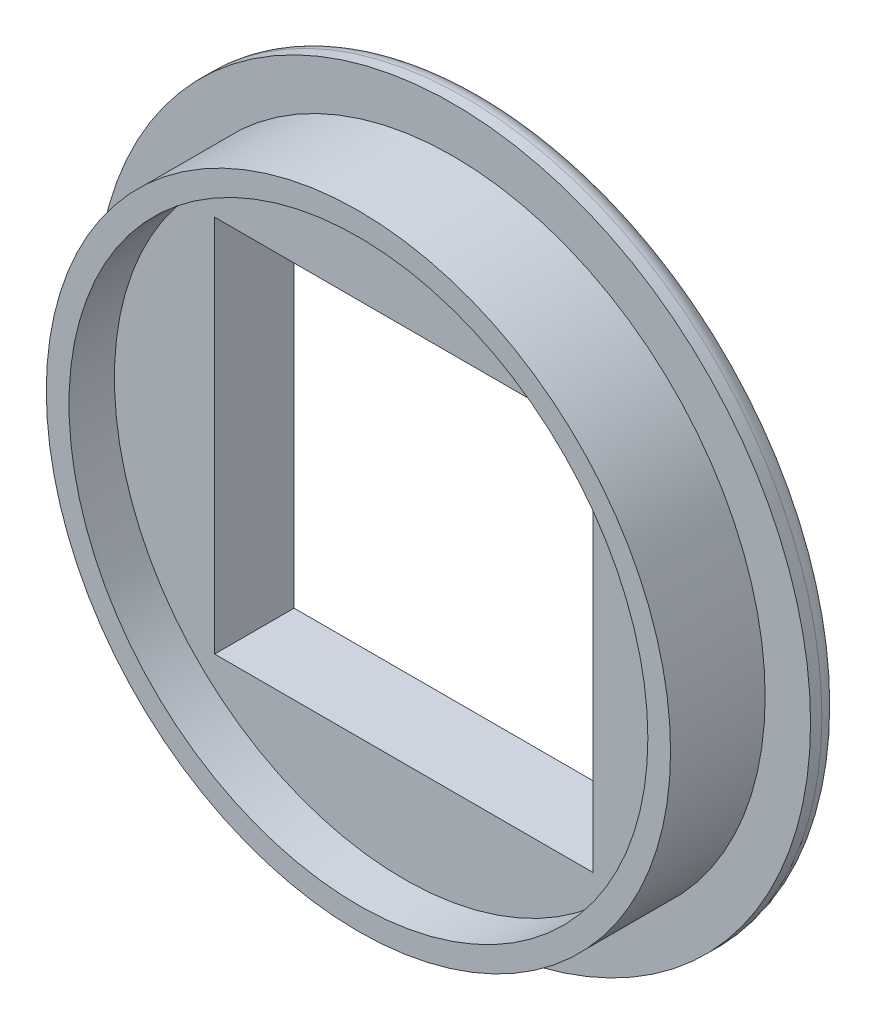
ISO-10303-21;
HEADER;
FILE_DESCRIPTION(('STEP AP214'),'2;1');
FILE_NAME('part.step','',(''),(''),'','','');
FILE_SCHEMA(('AUTOMOTIVE_DESIGN { 1 0 10303 214 1 1 1 1 }'));
ENDSEC;
DATA;
#1=APPLICATION_CONTEXT('core data for automotive mechanical design processes');
#2=APPLICATION_PROTOCOL_DEFINITION('international standard','automotive_design',2000,#1);
#3=PRODUCT_CONTEXT('',#1,'mechanical');
#4=PRODUCT('Part','Part','',(#3));
#5=PRODUCT_RELATED_PRODUCT_CATEGORY('part','',(#4));
#6=PRODUCT_DEFINITION_FORMATION('','',#4);
#7=PRODUCT_DEFINITION_CONTEXT('part definition',#1,'design');
#8=PRODUCT_DEFINITION('design','',#6,#7);
#9=PRODUCT_DEFINITION_SHAPE('','',#8);
#10=(LENGTH_UNIT() NAMED_UNIT(*) SI_UNIT(.MILLI.,.METRE.));
#11=(NAMED_UNIT(*) PLANE_ANGLE_UNIT() SI_UNIT($,.RADIAN.));
#12=(NAMED_UNIT(*) SI_UNIT($,.STERADIAN.) SOLID_ANGLE_UNIT());
#13=UNCERTAINTY_MEASURE_WITH_UNIT(LENGTH_MEASURE(1.E-05),#10,'distance_accuracy_value','');
#14=(GEOMETRIC_REPRESENTATION_CONTEXT(3) GLOBAL_UNCERTAINTY_ASSIGNED_CONTEXT((#13)) GLOBAL_UNIT_ASSIGNED_CONTEXT((#10,
#11,#12)) REPRESENTATION_CONTEXT('',''));
#15=CARTESIAN_POINT('',(0.,0.,0.));
#16=DIRECTION('',(0.,0.,1.));
#17=DIRECTION('',(1.,0.,0.));
#18=AXIS2_PLACEMENT_3D('',#15,#16,#17);
#19=CARTESIAN_POINT('',(5.,-5.,3.3));
#20=DIRECTION('',(-1.,0.,0.));
#21=DIRECTION('',(0.,0.,1.));
#22=AXIS2_PLACEMENT_3D('',#19,#20,#21);
#23=PLANE('',#22);
#24=DIRECTION('',(0.,0.,-1.));
#25=VECTOR('',#24,1.);
#26=CARTESIAN_POINT('',(5.,-5.,3.3));
#27=LINE('',#26,#25);
#28=CARTESIAN_POINT('',(5.,-5.,2.1));
#29=VERTEX_POINT('',#28);
#30=CARTESIAN_POINT('',(5.,-5.,0.));
#31=VERTEX_POINT('',#30);
#32=EDGE_CURVE('E56',#29,#31,#27,.T.);
#33=ORIENTED_EDGE('',*,*,#32,.F.);
#34=DIRECTION('',(0.,1.,0.));
#35=VECTOR('',#34,1.);
#36=CARTESIAN_POINT('',(5.,-5.,2.1));
#37=LINE('',#36,#35);
#38=CARTESIAN_POINT('',(5.,5.,2.1));
#39=VERTEX_POINT('',#38);
#40=EDGE_CURVE('E49',#29,#39,#37,.T.);
#41=ORIENTED_EDGE('',*,*,#40,.T.);
#42=DIRECTION('',(0.,0.,-1.));
#43=VECTOR('',#42,1.);
#44=CARTESIAN_POINT('',(5.,5.,3.3));
#45=LINE('',#44,#43);
#46=CARTESIAN_POINT('',(5.,5.,0.));
#47=VERTEX_POINT('',#46);
#48=EDGE_CURVE('E96',#39,#47,#45,.T.);
#49=ORIENTED_EDGE('',*,*,#48,.T.);
#50=DIRECTION('',(0.,1.,0.));
#51=VECTOR('',#50,1.);
#52=CARTESIAN_POINT('',(5.,-5.,0.));
#53=LINE('',#52,#51);
#54=EDGE_CURVE('E150',#31,#47,#53,.T.);
#55=ORIENTED_EDGE('',*,*,#54,.F.);
#56=EDGE_LOOP('',(#33,#41,#49,#55));
#57=FACE_BOUND('',#56,.T.);
#58=ADVANCED_FACE('F34',(#57),#23,.T.);
#59=CARTESIAN_POINT('',(-5.,5.,3.3));
#60=DIRECTION('',(0.,-1.,0.));
#61=DIRECTION('',(0.,0.,-1.));
#62=AXIS2_PLACEMENT_3D('',#59,#60,#61);
#63=PLANE('',#62);
#64=ORIENTED_EDGE('',*,*,#48,.F.);
#65=DIRECTION('',(-1.,0.,0.));
#66=VECTOR('',#65,1.);
#67=CARTESIAN_POINT('',(-5.,5.,2.1));
#68=LINE('',#67,#66);
#69=CARTESIAN_POINT('',(-5.,5.,2.1));
#70=VERTEX_POINT('',#69);
#71=EDGE_CURVE('E88',#39,#70,#68,.T.);
#72=ORIENTED_EDGE('',*,*,#71,.T.);
#73=DIRECTION('',(0.,0.,-1.));
#74=VECTOR('',#73,1.);
#75=CARTESIAN_POINT('',(-5.,5.,3.3));
#76=LINE('',#75,#74);
#77=CARTESIAN_POINT('',(-5.,5.,0.));
#78=VERTEX_POINT('',#77);
#79=EDGE_CURVE('E87',#70,#78,#76,.T.);
#80=ORIENTED_EDGE('',*,*,#79,.T.);
#81=DIRECTION('',(-1.,0.,0.));
#82=VECTOR('',#81,1.);
#83=CARTESIAN_POINT('',(-5.,5.,0.));
#84=LINE('',#83,#82);
#85=EDGE_CURVE('E154',#47,#78,#84,.T.);
#86=ORIENTED_EDGE('',*,*,#85,.F.);
#87=EDGE_LOOP('',(#64,#72,#80,#86));
#88=FACE_BOUND('',#87,.T.);
#89=ADVANCED_FACE('F118',(#88),#63,.T.);
#90=CARTESIAN_POINT('',(-5.,-5.,3.3));
#91=DIRECTION('',(1.,0.,0.));
#92=DIRECTION('',(0.,0.,-1.));
#93=AXIS2_PLACEMENT_3D('',#90,#91,#92);
#94=PLANE('',#93);
#95=ORIENTED_EDGE('',*,*,#79,.F.);
#96=DIRECTION('',(0.,-1.,0.));
#97=VECTOR('',#96,1.);
#98=CARTESIAN_POINT('',(-5.,-5.,2.1));
#99=LINE('',#98,#97);
#100=CARTESIAN_POINT('',(-5.,-5.,2.1));
#101=VERTEX_POINT('',#100);
#102=EDGE_CURVE('E77',#70,#101,#99,.T.);
#103=ORIENTED_EDGE('',*,*,#102,.T.);
#104=DIRECTION('',(0.,0.,-1.));
#105=VECTOR('',#104,1.);
#106=CARTESIAN_POINT('',(-5.,-5.,3.3));
#107=LINE('',#106,#105);
#108=CARTESIAN_POINT('',(-5.,-5.,0.));
#109=VERTEX_POINT('',#108);
#110=EDGE_CURVE('E86',#101,#109,#107,.T.);
#111=ORIENTED_EDGE('',*,*,#110,.T.);
#112=DIRECTION('',(0.,-1.,0.));
#113=VECTOR('',#112,1.);
#114=CARTESIAN_POINT('',(-5.,-5.,0.));
#115=LINE('',#114,#113);
#116=EDGE_CURVE('E162',#78,#109,#115,.T.);
#117=ORIENTED_EDGE('',*,*,#116,.F.);
#118=EDGE_LOOP('',(#95,#103,#111,#117));
#119=FACE_BOUND('',#118,.T.);
#120=ADVANCED_FACE('F84',(#119),#94,.T.);
#121=CARTESIAN_POINT('',(-5.,-5.,3.3));
#122=DIRECTION('',(0.,1.,0.));
#123=DIRECTION('',(0.,0.,1.));
#124=AXIS2_PLACEMENT_3D('',#121,#122,#123);
#125=PLANE('',#124);
#126=ORIENTED_EDGE('',*,*,#110,.F.);
#127=DIRECTION('',(1.,0.,0.));
#128=VECTOR('',#127,1.);
#129=CARTESIAN_POINT('',(-5.,-5.,2.1));
#130=LINE('',#129,#128);
#131=EDGE_CURVE('E73',#101,#29,#130,.T.);
#132=ORIENTED_EDGE('',*,*,#131,.T.);
#133=ORIENTED_EDGE('',*,*,#32,.T.);
#134=DIRECTION('',(1.,0.,0.));
#135=VECTOR('',#134,1.);
#136=CARTESIAN_POINT('',(-5.,-5.,0.));
#137=LINE('',#136,#135);
#138=EDGE_CURVE('E93',#109,#31,#137,.T.);
#139=ORIENTED_EDGE('',*,*,#138,.F.);
#140=EDGE_LOOP('',(#126,#132,#133,#139));
#141=FACE_BOUND('',#140,.T.);
#142=ADVANCED_FACE('F91',(#141),#125,.T.);
#143=CARTESIAN_POINT('',(0.,0.,3.3));
#144=DIRECTION('',(0.,0.,1.));
#145=DIRECTION('',(1.,0.,0.));
#146=AXIS2_PLACEMENT_3D('',#143,#144,#145);
#147=PLANE('',#146);
#148=CARTESIAN_POINT('',(0.,0.,3.3));
#149=DIRECTION('',(0.,0.,1.));
#150=DIRECTION('',(1.,0.,0.));
#151=AXIS2_PLACEMENT_3D('',#148,#149,#150);
#152=CIRCLE('',#151,7.65);
#153=CARTESIAN_POINT('',(7.65,0.,3.3));
#154=VERTEX_POINT('',#153);
#155=EDGE_CURVE('E167',#154,#154,#152,.T.);
#156=ORIENTED_EDGE('',*,*,#155,.F.);
#157=EDGE_LOOP('',(#156));
#158=FACE_BOUND('',#157,.T.);
#159=CARTESIAN_POINT('',(0.,0.,3.3));
#160=DIRECTION('',(0.,0.,1.));
#161=DIRECTION('',(1.,0.,0.));
#162=AXIS2_PLACEMENT_3D('',#159,#160,#161);
#163=CIRCLE('',#162,8.25);
#164=CARTESIAN_POINT('',(8.25,0.,3.3));
#165=VERTEX_POINT('',#164);
#166=EDGE_CURVE('E80',#165,#165,#163,.T.);
#167=ORIENTED_EDGE('',*,*,#166,.T.);
#168=EDGE_LOOP('',(#167));
#169=FACE_BOUND('',#168,.T.);
#170=ADVANCED_FACE('F128',(#158,#169),#147,.T.);
#171=CARTESIAN_POINT('',(0.,0.,0.));
#172=DIRECTION('',(0.,0.,1.));
#173=DIRECTION('',(1.,0.,0.));
#174=AXIS2_PLACEMENT_3D('',#171,#172,#173);
#175=PLANE('',#174);
#176=CARTESIAN_POINT('',(0.,0.,0.));
#177=DIRECTION('',(0.,0.,1.));
#178=DIRECTION('',(1.,0.,0.));
#179=AXIS2_PLACEMENT_3D('',#176,#177,#178);
#180=CIRCLE('',#179,8.95);
#181=CARTESIAN_POINT('',(8.95,0.,0.));
#182=VERTEX_POINT('',#181);
#183=EDGE_CURVE('E42',#182,#182,#180,.F.);
#184=ORIENTED_EDGE('',*,*,#183,.T.);
#185=EDGE_LOOP('',(#184));
#186=FACE_BOUND('',#185,.T.);
#187=ORIENTED_EDGE('',*,*,#54,.T.);
#188=ORIENTED_EDGE('',*,*,#85,.T.);
#189=ORIENTED_EDGE('',*,*,#116,.T.);
#190=ORIENTED_EDGE('',*,*,#138,.T.);
#191=EDGE_LOOP('',(#187,#188,#189,#190));
#192=FACE_BOUND('',#191,.T.);
#193=ADVANCED_FACE('F106',(#186,#192),#175,.F.);
#194=CARTESIAN_POINT('',(0.,0.,3.3));
#195=DIRECTION('',(0.,0.,-1.));
#196=DIRECTION('',(-1.,0.,0.));
#197=AXIS2_PLACEMENT_3D('',#194,#195,#196);
#198=CYLINDRICAL_SURFACE('',#197,8.25);
#199=CARTESIAN_POINT('',(0.,0.,0.8));
#200=DIRECTION('',(0.,0.,1.));
#201=DIRECTION('',(1.,0.,0.));
#202=AXIS2_PLACEMENT_3D('',#199,#200,#201);
#203=CIRCLE('',#202,8.25);
#204=CARTESIAN_POINT('',(8.25,0.,0.8));
#205=VERTEX_POINT('',#204);
#206=EDGE_CURVE('E146',#205,#205,#203,.T.);
#207=ORIENTED_EDGE('',*,*,#206,.T.);
#208=EDGE_LOOP('',(#207));
#209=FACE_BOUND('',#208,.T.);
#210=ORIENTED_EDGE('',*,*,#166,.F.);
#211=EDGE_LOOP('',(#210));
#212=FACE_BOUND('',#211,.T.);
#213=ADVANCED_FACE('F133',(#209,#212),#198,.T.);
#214=CARTESIAN_POINT('',(0.,0.,0.8));
#215=DIRECTION('',(0.,0.,1.));
#216=DIRECTION('',(1.,0.,0.));
#217=AXIS2_PLACEMENT_3D('',#214,#215,#216);
#218=PLANE('',#217);
#219=CARTESIAN_POINT('',(0.,0.,0.799999999999999));
#220=DIRECTION('',(0.,0.,1.));
#221=DIRECTION('',(1.,0.,0.));
#222=AXIS2_PLACEMENT_3D('',#219,#220,#221);
#223=CIRCLE('',#222,9.45);
#224=CARTESIAN_POINT('',(9.45,0.,0.799999999999999));
#225=VERTEX_POINT('',#224);
#226=EDGE_CURVE('E151',#225,#225,#223,.F.);
#227=ORIENTED_EDGE('',*,*,#226,.F.);
#228=EDGE_LOOP('',(#227));
#229=FACE_BOUND('',#228,.T.);
#230=ORIENTED_EDGE('',*,*,#206,.F.);
#231=EDGE_LOOP('',(#230));
#232=FACE_BOUND('',#231,.T.);
#233=ADVANCED_FACE('F135',(#229,#232),#218,.T.);
#234=CARTESIAN_POINT('',(0.,0.,30.0286363288515));
#235=DIRECTION('',(0.,0.,-1.));
#236=DIRECTION('',(-1.,0.,0.));
#237=AXIS2_PLACEMENT_3D('',#234,#235,#236);
#238=CYLINDRICAL_SURFACE('',#237,9.45);
#239=CARTESIAN_POINT('',(0.,0.,0.5));
#240=DIRECTION('',(0.,0.,1.));
#241=DIRECTION('',(1.,0.,0.));
#242=AXIS2_PLACEMENT_3D('',#239,#240,#241);
#243=CIRCLE('',#242,9.45);
#244=CARTESIAN_POINT('',(9.45,0.,0.5));
#245=VERTEX_POINT('',#244);
#246=EDGE_CURVE('E12',#245,#245,#243,.T.);
#247=ORIENTED_EDGE('',*,*,#246,.T.);
#248=EDGE_LOOP('',(#247));
#249=FACE_BOUND('',#248,.T.);
#250=ORIENTED_EDGE('',*,*,#226,.T.);
#251=EDGE_LOOP('',(#250));
#252=FACE_BOUND('',#251,.T.);
#253=ADVANCED_FACE('F140',(#249,#252),#238,.T.);
#254=CARTESIAN_POINT('',(0.,0.,2.1));
#255=DIRECTION('',(0.,0.,1.));
#256=DIRECTION('',(1.,0.,0.));
#257=AXIS2_PLACEMENT_3D('',#254,#255,#256);
#258=CYLINDRICAL_SURFACE('',#257,7.65);
#259=CARTESIAN_POINT('',(0.,0.,2.1));
#260=DIRECTION('',(0.,0.,1.));
#261=DIRECTION('',(1.,0.,0.));
#262=AXIS2_PLACEMENT_3D('',#259,#260,#261);
#263=CIRCLE('',#262,7.65);
#264=CARTESIAN_POINT('',(7.65,0.,2.1));
#265=VERTEX_POINT('',#264);
#266=EDGE_CURVE('E89',#265,#265,#263,.T.);
#267=ORIENTED_EDGE('',*,*,#266,.F.);
#268=EDGE_LOOP('',(#267));
#269=FACE_BOUND('',#268,.T.);
#270=ORIENTED_EDGE('',*,*,#155,.T.);
#271=EDGE_LOOP('',(#270));
#272=FACE_BOUND('',#271,.T.);
#273=ADVANCED_FACE('F114',(#269,#272),#258,.F.);
#274=CARTESIAN_POINT('',(0.,0.,2.1));
#275=DIRECTION('',(0.,0.,1.));
#276=DIRECTION('',(1.,0.,0.));
#277=AXIS2_PLACEMENT_3D('',#274,#275,#276);
#278=PLANE('',#277);
#279=ORIENTED_EDGE('',*,*,#131,.F.);
#280=ORIENTED_EDGE('',*,*,#102,.F.);
#281=ORIENTED_EDGE('',*,*,#71,.F.);
#282=ORIENTED_EDGE('',*,*,#40,.F.);
#283=EDGE_LOOP('',(#279,#280,#281,#282));
#284=FACE_BOUND('',#283,.T.);
#285=ORIENTED_EDGE('',*,*,#266,.T.);
#286=EDGE_LOOP('',(#285));
#287=FACE_BOUND('',#286,.T.);
#288=ADVANCED_FACE('F75',(#284,#287),#278,.T.);
#289=CARTESIAN_POINT('',(0.,0.,0.5));
#290=DIRECTION('',(0.,0.,1.));
#291=DIRECTION('',(1.,0.,0.));
#292=AXIS2_PLACEMENT_3D('',#289,#290,#291);
#293=TOROIDAL_SURFACE('',#292,8.95,0.5);
#294=ORIENTED_EDGE('',*,*,#246,.F.);
#295=EDGE_LOOP('',(#294));
#296=FACE_BOUND('',#295,.T.);
#297=ORIENTED_EDGE('',*,*,#183,.F.);
#298=EDGE_LOOP('',(#297));
#299=FACE_BOUND('',#298,.T.);
#300=ADVANCED_FACE('F36',(#296,#299),#293,.T.);
#301=CLOSED_SHELL('',(#58,#89,#120,#142,#170,#193,#213,#233,#253,#273,#288,#300));
#302=MANIFOLD_SOLID_BREP('B2',#301);
#303=ADVANCED_BREP_SHAPE_REPRESENTATION('',(#18,#302),#14);
#304=SHAPE_DEFINITION_REPRESENTATION(#9,#303);
ENDSEC;
END-ISO-10303-21;
